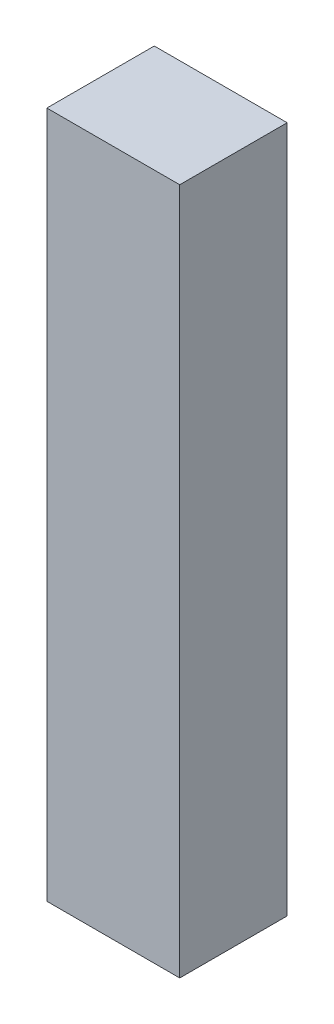
ISO-10303-21;
HEADER;
FILE_DESCRIPTION(('STEP AP214'),'2;1');
FILE_NAME('part.step','',(''),(''),'','','');
FILE_SCHEMA(('AUTOMOTIVE_DESIGN { 1 0 10303 214 1 1 1 1 }'));
ENDSEC;
DATA;
#1=APPLICATION_CONTEXT('core data for automotive mechanical design processes');
#2=APPLICATION_PROTOCOL_DEFINITION('international standard','automotive_design',2000,#1);
#3=PRODUCT_CONTEXT('',#1,'mechanical');
#4=PRODUCT('Part','Part','',(#3));
#5=PRODUCT_RELATED_PRODUCT_CATEGORY('part','',(#4));
#6=PRODUCT_DEFINITION_FORMATION('','',#4);
#7=PRODUCT_DEFINITION_CONTEXT('part definition',#1,'design');
#8=PRODUCT_DEFINITION('design','',#6,#7);
#9=PRODUCT_DEFINITION_SHAPE('','',#8);
#10=(LENGTH_UNIT() NAMED_UNIT(*) SI_UNIT(.MILLI.,.METRE.));
#11=(NAMED_UNIT(*) PLANE_ANGLE_UNIT() SI_UNIT($,.RADIAN.));
#12=(NAMED_UNIT(*) SI_UNIT($,.STERADIAN.) SOLID_ANGLE_UNIT());
#13=UNCERTAINTY_MEASURE_WITH_UNIT(LENGTH_MEASURE(1.E-05),#10,'distance_accuracy_value','');
#14=(GEOMETRIC_REPRESENTATION_CONTEXT(3) GLOBAL_UNCERTAINTY_ASSIGNED_CONTEXT((#13)) GLOBAL_UNIT_ASSIGNED_CONTEXT((#10,
#11,#12)) REPRESENTATION_CONTEXT('',''));
#15=CARTESIAN_POINT('',(0.,0.,0.));
#16=DIRECTION('',(0.,0.,1.));
#17=DIRECTION('',(1.,0.,0.));
#18=AXIS2_PLACEMENT_3D('',#15,#16,#17);
#19=CARTESIAN_POINT('',(0.29845,1.54305,0.4826));
#20=DIRECTION('',(0.,0.,-1.));
#21=DIRECTION('',(-1.,0.,0.));
#22=AXIS2_PLACEMENT_3D('',#19,#20,#21);
#23=PLANE('',#22);
#24=DIRECTION('',(0.,1.,0.));
#25=VECTOR('',#24,1.);
#26=CARTESIAN_POINT('',(-0.29845,1.54305,0.4826));
#27=LINE('',#26,#25);
#28=CARTESIAN_POINT('',(-0.29845,1.54305,0.4826));
#29=VERTEX_POINT('',#28);
#30=CARTESIAN_POINT('',(-0.29845,-1.54305,0.4826));
#31=VERTEX_POINT('',#30);
#32=EDGE_CURVE('E55',#29,#31,#27,.F.);
#33=ORIENTED_EDGE('',*,*,#32,.T.);
#34=DIRECTION('',(1.,0.,0.));
#35=VECTOR('',#34,1.);
#36=CARTESIAN_POINT('',(-0.29845,-1.54305,0.4826));
#37=LINE('',#36,#35);
#38=CARTESIAN_POINT('',(0.29845,-1.54305,0.4826));
#39=VERTEX_POINT('',#38);
#40=EDGE_CURVE('E58',#31,#39,#37,.T.);
#41=ORIENTED_EDGE('',*,*,#40,.T.);
#42=DIRECTION('',(0.,1.,0.));
#43=VECTOR('',#42,1.);
#44=CARTESIAN_POINT('',(0.29845,-1.54305,0.4826));
#45=LINE('',#44,#43);
#46=CARTESIAN_POINT('',(0.29845,1.54305,0.4826));
#47=VERTEX_POINT('',#46);
#48=EDGE_CURVE('E60',#39,#47,#45,.T.);
#49=ORIENTED_EDGE('',*,*,#48,.T.);
#50=DIRECTION('',(-1.,0.,0.));
#51=VECTOR('',#50,1.);
#52=CARTESIAN_POINT('',(0.29845,1.54305,0.4826));
#53=LINE('',#52,#51);
#54=EDGE_CURVE('E20',#29,#47,#53,.F.);
#55=ORIENTED_EDGE('',*,*,#54,.F.);
#56=EDGE_LOOP('',(#33,#41,#49,#55));
#57=FACE_BOUND('',#56,.T.);
#58=ADVANCED_FACE('F17',(#57),#23,.F.);
#59=CARTESIAN_POINT('',(0.29845,-1.54305,0.));
#60=DIRECTION('',(-1.,0.,0.));
#61=DIRECTION('',(0.,0.,1.));
#62=AXIS2_PLACEMENT_3D('',#59,#60,#61);
#63=PLANE('',#62);
#64=DIRECTION('',(0.,0.,-1.));
#65=VECTOR('',#64,1.);
#66=CARTESIAN_POINT('',(0.29845,1.54305,0.));
#67=LINE('',#66,#65);
#68=CARTESIAN_POINT('',(0.29845,1.54305,0.));
#69=VERTEX_POINT('',#68);
#70=EDGE_CURVE('E71',#69,#47,#67,.F.);
#71=ORIENTED_EDGE('',*,*,#70,.T.);
#72=ORIENTED_EDGE('',*,*,#48,.F.);
#73=DIRECTION('',(0.,0.,1.));
#74=VECTOR('',#73,1.);
#75=CARTESIAN_POINT('',(0.29845,-1.54305,0.));
#76=LINE('',#75,#74);
#77=CARTESIAN_POINT('',(0.29845,-1.54305,0.));
#78=VERTEX_POINT('',#77);
#79=EDGE_CURVE('E65',#39,#78,#76,.F.);
#80=ORIENTED_EDGE('',*,*,#79,.T.);
#81=DIRECTION('',(0.,1.,0.));
#82=VECTOR('',#81,1.);
#83=CARTESIAN_POINT('',(0.29845,1.54305,0.));
#84=LINE('',#83,#82);
#85=EDGE_CURVE('E83',#69,#78,#84,.F.);
#86=ORIENTED_EDGE('',*,*,#85,.F.);
#87=EDGE_LOOP('',(#71,#72,#80,#86));
#88=FACE_BOUND('',#87,.T.);
#89=ADVANCED_FACE('F68',(#88),#63,.F.);
#90=CARTESIAN_POINT('',(-0.29845,-1.54305,0.));
#91=DIRECTION('',(0.,1.,0.));
#92=DIRECTION('',(0.,0.,1.));
#93=AXIS2_PLACEMENT_3D('',#90,#91,#92);
#94=PLANE('',#93);
#95=ORIENTED_EDGE('',*,*,#79,.F.);
#96=ORIENTED_EDGE('',*,*,#40,.F.);
#97=DIRECTION('',(0.,0.,-1.));
#98=VECTOR('',#97,1.);
#99=CARTESIAN_POINT('',(-0.29845,-1.54305,0.));
#100=LINE('',#99,#98);
#101=CARTESIAN_POINT('',(-0.29845,-1.54305,0.));
#102=VERTEX_POINT('',#101);
#103=EDGE_CURVE('E77',#31,#102,#100,.T.);
#104=ORIENTED_EDGE('',*,*,#103,.T.);
#105=DIRECTION('',(-1.,0.,0.));
#106=VECTOR('',#105,1.);
#107=CARTESIAN_POINT('',(0.29845,-1.54305,0.));
#108=LINE('',#107,#106);
#109=EDGE_CURVE('E74',#78,#102,#108,.T.);
#110=ORIENTED_EDGE('',*,*,#109,.F.);
#111=EDGE_LOOP('',(#95,#96,#104,#110));
#112=FACE_BOUND('',#111,.T.);
#113=ADVANCED_FACE('F72',(#112),#94,.F.);
#114=CARTESIAN_POINT('',(-0.29845,1.54305,0.));
#115=DIRECTION('',(1.,0.,0.));
#116=DIRECTION('',(0.,0.,-1.));
#117=AXIS2_PLACEMENT_3D('',#114,#115,#116);
#118=PLANE('',#117);
#119=ORIENTED_EDGE('',*,*,#103,.F.);
#120=ORIENTED_EDGE('',*,*,#32,.F.);
#121=DIRECTION('',(0.,0.,-1.));
#122=VECTOR('',#121,1.);
#123=CARTESIAN_POINT('',(-0.29845,1.54305,0.));
#124=LINE('',#123,#122);
#125=CARTESIAN_POINT('',(-0.29845,1.54305,0.));
#126=VERTEX_POINT('',#125);
#127=EDGE_CURVE('E35',#29,#126,#124,.T.);
#128=ORIENTED_EDGE('',*,*,#127,.T.);
#129=DIRECTION('',(0.,1.,0.));
#130=VECTOR('',#129,1.);
#131=CARTESIAN_POINT('',(-0.29845,1.54305,0.));
#132=LINE('',#131,#130);
#133=EDGE_CURVE('E26',#102,#126,#132,.T.);
#134=ORIENTED_EDGE('',*,*,#133,.F.);
#135=EDGE_LOOP('',(#119,#120,#128,#134));
#136=FACE_BOUND('',#135,.T.);
#137=ADVANCED_FACE('F89',(#136),#118,.F.);
#138=CARTESIAN_POINT('',(0.29845,1.54305,0.));
#139=DIRECTION('',(0.,-1.,0.));
#140=DIRECTION('',(0.,0.,-1.));
#141=AXIS2_PLACEMENT_3D('',#138,#139,#140);
#142=PLANE('',#141);
#143=ORIENTED_EDGE('',*,*,#127,.F.);
#144=ORIENTED_EDGE('',*,*,#54,.T.);
#145=ORIENTED_EDGE('',*,*,#70,.F.);
#146=DIRECTION('',(-1.,0.,0.));
#147=VECTOR('',#146,1.);
#148=CARTESIAN_POINT('',(0.29845,1.54305,0.));
#149=LINE('',#148,#147);
#150=EDGE_CURVE('E11',#126,#69,#149,.F.);
#151=ORIENTED_EDGE('',*,*,#150,.F.);
#152=EDGE_LOOP('',(#143,#144,#145,#151));
#153=FACE_BOUND('',#152,.T.);
#154=ADVANCED_FACE('F91',(#153),#142,.F.);
#155=CARTESIAN_POINT('',(0.29845,1.54305,0.));
#156=DIRECTION('',(0.,0.,-1.));
#157=DIRECTION('',(-1.,0.,0.));
#158=AXIS2_PLACEMENT_3D('',#155,#156,#157);
#159=PLANE('',#158);
#160=ORIENTED_EDGE('',*,*,#133,.T.);
#161=ORIENTED_EDGE('',*,*,#150,.T.);
#162=ORIENTED_EDGE('',*,*,#85,.T.);
#163=ORIENTED_EDGE('',*,*,#109,.T.);
#164=EDGE_LOOP('',(#160,#161,#162,#163));
#165=FACE_BOUND('',#164,.T.);
#166=ADVANCED_FACE('F88',(#165),#159,.T.);
#167=CLOSED_SHELL('',(#58,#89,#113,#137,#154,#166));
#168=MANIFOLD_SOLID_BREP('B1',#167);
#169=ADVANCED_BREP_SHAPE_REPRESENTATION('',(#18,#168),#14);
#170=SHAPE_DEFINITION_REPRESENTATION(#9,#169);
ENDSEC;
END-ISO-10303-21;
